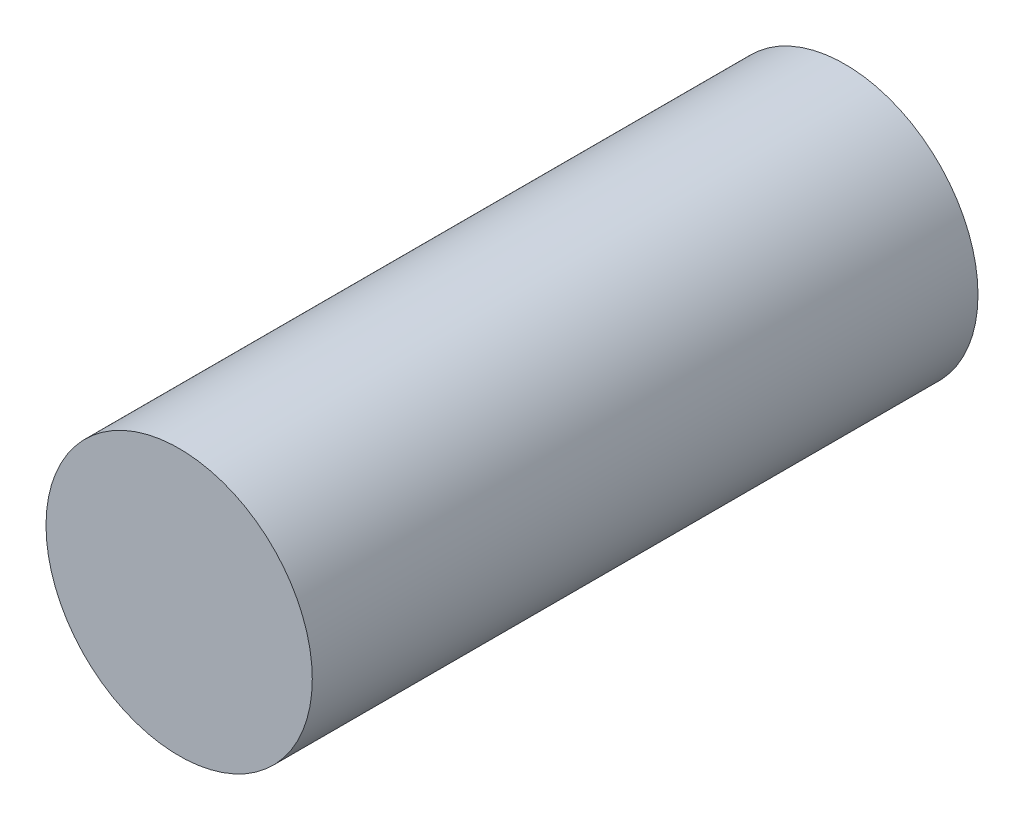
ISO-10303-21;
HEADER;
FILE_DESCRIPTION(('STEP AP214'),'2;1');
FILE_NAME('part.step','',(''),(''),'','','');
FILE_SCHEMA(('AUTOMOTIVE_DESIGN { 1 0 10303 214 1 1 1 1 }'));
ENDSEC;
DATA;
#1=APPLICATION_CONTEXT('core data for automotive mechanical design processes');
#2=APPLICATION_PROTOCOL_DEFINITION('international standard','automotive_design',2000,#1);
#3=PRODUCT_CONTEXT('',#1,'mechanical');
#4=PRODUCT('Part','Part','',(#3));
#5=PRODUCT_RELATED_PRODUCT_CATEGORY('part','',(#4));
#6=PRODUCT_DEFINITION_FORMATION('','',#4);
#7=PRODUCT_DEFINITION_CONTEXT('part definition',#1,'design');
#8=PRODUCT_DEFINITION('design','',#6,#7);
#9=PRODUCT_DEFINITION_SHAPE('','',#8);
#10=(LENGTH_UNIT() NAMED_UNIT(*) SI_UNIT(.MILLI.,.METRE.));
#11=(NAMED_UNIT(*) PLANE_ANGLE_UNIT() SI_UNIT($,.RADIAN.));
#12=(NAMED_UNIT(*) SI_UNIT($,.STERADIAN.) SOLID_ANGLE_UNIT());
#13=UNCERTAINTY_MEASURE_WITH_UNIT(LENGTH_MEASURE(1.E-05),#10,'distance_accuracy_value','');
#14=(GEOMETRIC_REPRESENTATION_CONTEXT(3) GLOBAL_UNCERTAINTY_ASSIGNED_CONTEXT((#13)) GLOBAL_UNIT_ASSIGNED_CONTEXT((#10,
#11,#12)) REPRESENTATION_CONTEXT('',''));
#15=CARTESIAN_POINT('',(0.,0.,0.));
#16=DIRECTION('',(0.,0.,1.));
#17=DIRECTION('',(1.,0.,0.));
#18=AXIS2_PLACEMENT_3D('',#15,#16,#17);
#19=CARTESIAN_POINT('',(0.80000094,0.,3.99999962));
#20=DIRECTION('',(0.,0.,-1.));
#21=DIRECTION('',(0.,-1.,0.));
#22=AXIS2_PLACEMENT_3D('',#19,#20,#21);
#23=PLANE('',#22);
#24=CARTESIAN_POINT('',(0.,0.,3.99999962));
#25=DIRECTION('',(0.,0.,1.));
#26=DIRECTION('',(1.,0.,0.));
#27=AXIS2_PLACEMENT_3D('',#24,#25,#26);
#28=CIRCLE('',#27,0.80000094);
#29=CARTESIAN_POINT('',(-0.80000094,0.,3.99999962));
#30=VERTEX_POINT('',#29);
#31=EDGE_CURVE('E11',#30,#30,#28,.T.);
#32=ORIENTED_EDGE('',*,*,#31,.T.);
#33=EDGE_LOOP('',(#32));
#34=FACE_BOUND('',#33,.T.);
#35=ADVANCED_FACE('F17',(#34),#23,.F.);
#36=CARTESIAN_POINT('',(0.80000094,0.,0.));
#37=DIRECTION('',(0.,0.,-1.));
#38=DIRECTION('',(0.,-1.,0.));
#39=AXIS2_PLACEMENT_3D('',#36,#37,#38);
#40=PLANE('',#39);
#41=CARTESIAN_POINT('',(0.,0.,0.));
#42=DIRECTION('',(0.,0.,1.));
#43=DIRECTION('',(1.,0.,0.));
#44=AXIS2_PLACEMENT_3D('',#41,#42,#43);
#45=CIRCLE('',#44,0.80000094);
#46=CARTESIAN_POINT('',(-0.80000094,0.,0.));
#47=VERTEX_POINT('',#46);
#48=EDGE_CURVE('E42',#47,#47,#45,.T.);
#49=ORIENTED_EDGE('',*,*,#48,.F.);
#50=EDGE_LOOP('',(#49));
#51=FACE_BOUND('',#50,.T.);
#52=ADVANCED_FACE('F64',(#51),#40,.T.);
#53=CARTESIAN_POINT('',(0.,0.,0.));
#54=DIRECTION('',(0.,0.,-1.));
#55=DIRECTION('',(1.,0.,0.));
#56=AXIS2_PLACEMENT_3D('',#53,#54,#55);
#57=CYLINDRICAL_SURFACE('',#56,0.80000094);
#58=ORIENTED_EDGE('',*,*,#48,.T.);
#59=DIRECTION('',(0.,0.,1.));
#60=VECTOR('',#59,1.);
#61=CARTESIAN_POINT('',(-0.80000094,0.,0.));
#62=LINE('',#61,#60);
#63=EDGE_CURVE('E25',#47,#30,#62,.T.);
#64=ORIENTED_EDGE('',*,*,#63,.T.);
#65=ORIENTED_EDGE('',*,*,#31,.F.);
#66=ORIENTED_EDGE('',*,*,#63,.F.);
#67=EDGE_LOOP('',(#58,#64,#65,#66));
#68=FACE_BOUND('',#67,.T.);
#69=ADVANCED_FACE('F40',(#68),#57,.T.);
#70=CLOSED_SHELL('',(#35,#52,#69));
#71=MANIFOLD_SOLID_BREP('B1',#70);
#72=ADVANCED_BREP_SHAPE_REPRESENTATION('',(#18,#71),#14);
#73=SHAPE_DEFINITION_REPRESENTATION(#9,#72);
ENDSEC;
END-ISO-10303-21;
